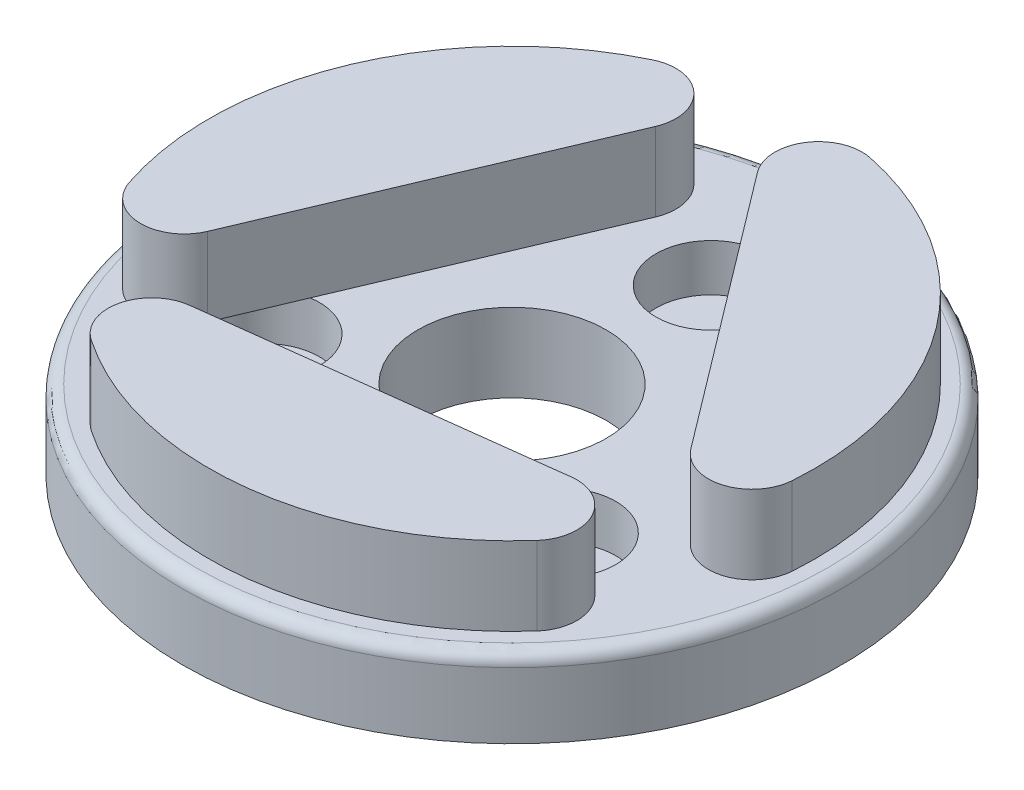
ISO-10303-21;
HEADER;
FILE_DESCRIPTION(('STEP AP214'),'2;1');
FILE_NAME('part.step','',(''),(''),'','','');
FILE_SCHEMA(('AUTOMOTIVE_DESIGN { 1 0 10303 214 1 1 1 1 }'));
ENDSEC;
DATA;
#1=APPLICATION_CONTEXT('core data for automotive mechanical design processes');
#2=APPLICATION_PROTOCOL_DEFINITION('international standard','automotive_design',2000,#1);
#3=PRODUCT_CONTEXT('',#1,'mechanical');
#4=PRODUCT('Part','Part','',(#3));
#5=PRODUCT_RELATED_PRODUCT_CATEGORY('part','',(#4));
#6=PRODUCT_DEFINITION_FORMATION('','',#4);
#7=PRODUCT_DEFINITION_CONTEXT('part definition',#1,'design');
#8=PRODUCT_DEFINITION('design','',#6,#7);
#9=PRODUCT_DEFINITION_SHAPE('','',#8);
#10=(LENGTH_UNIT() NAMED_UNIT(*) SI_UNIT(.MILLI.,.METRE.));
#11=(NAMED_UNIT(*) PLANE_ANGLE_UNIT() SI_UNIT($,.RADIAN.));
#12=(NAMED_UNIT(*) SI_UNIT($,.STERADIAN.) SOLID_ANGLE_UNIT());
#13=UNCERTAINTY_MEASURE_WITH_UNIT(LENGTH_MEASURE(1.E-05),#10,'distance_accuracy_value','');
#14=(GEOMETRIC_REPRESENTATION_CONTEXT(3) GLOBAL_UNCERTAINTY_ASSIGNED_CONTEXT((#13)) GLOBAL_UNIT_ASSIGNED_CONTEXT((#10,
#11,#12)) REPRESENTATION_CONTEXT('',''));
#15=CARTESIAN_POINT('',(0.,0.,0.));
#16=DIRECTION('',(0.,0.,1.));
#17=DIRECTION('',(1.,0.,0.));
#18=AXIS2_PLACEMENT_3D('',#15,#16,#17);
#19=CARTESIAN_POINT('',(0.,0.,0.));
#20=DIRECTION('',(0.,-1.,0.));
#21=DIRECTION('',(0.,0.,-1.));
#22=AXIS2_PLACEMENT_3D('',#19,#20,#21);
#23=CYLINDRICAL_SURFACE('',#22,5.99999999999999);
#24=CARTESIAN_POINT('',(0.,31.0875,0.));
#25=DIRECTION('',(0.,1.,0.));
#26=DIRECTION('',(0.,0.,1.));
#27=AXIS2_PLACEMENT_3D('',#24,#25,#26);
#28=CIRCLE('',#27,5.99999999999999);
#29=CARTESIAN_POINT('',(0.,31.0875,5.99999999999999));
#30=VERTEX_POINT('',#29);
#31=EDGE_CURVE('E425',#30,#30,#28,.T.);
#32=ORIENTED_EDGE('',*,*,#31,.F.);
#33=EDGE_LOOP('',(#32));
#34=FACE_BOUND('',#33,.T.);
#35=CARTESIAN_POINT('',(0.,36.0875,0.));
#36=DIRECTION('',(0.,-1.,0.));
#37=DIRECTION('',(0.,0.,-1.));
#38=AXIS2_PLACEMENT_3D('',#35,#36,#37);
#39=CIRCLE('',#38,5.99999999999999);
#40=CARTESIAN_POINT('',(0.,36.0875,-5.99999999999999));
#41=VERTEX_POINT('',#40);
#42=EDGE_CURVE('E301',#41,#41,#39,.T.);
#43=ORIENTED_EDGE('',*,*,#42,.F.);
#44=EDGE_LOOP('',(#43));
#45=FACE_BOUND('',#44,.T.);
#46=ADVANCED_FACE('F47',(#34,#45),#23,.F.);
#47=CARTESIAN_POINT('',(21.,36.0875,0.));
#48=DIRECTION('',(0.,1.,0.));
#49=DIRECTION('',(0.,0.,1.));
#50=AXIS2_PLACEMENT_3D('',#47,#48,#49);
#51=PLANE('',#50);
#52=CARTESIAN_POINT('',(-10.6521533525861,36.0875,5.12631170409008));
#53=DIRECTION('',(0.,1.,0.));
#54=DIRECTION('',(0.,0.,1.));
#55=AXIS2_PLACEMENT_3D('',#52,#53,#54);
#56=CIRCLE('',#55,3.5);
#57=CARTESIAN_POINT('',(-13.5963596262202,36.0875,7.018836319067));
#58=VERTEX_POINT('',#57);
#59=CARTESIAN_POINT('',(-11.1837255790534,36.0875,1.66691421781468));
#60=VERTEX_POINT('',#59);
#61=EDGE_CURVE('E440',#58,#60,#56,.T.);
#62=ORIENTED_EDGE('',*,*,#61,.F.);
#63=CARTESIAN_POINT('',(-15.6896930870227,36.0875,5.19439017263042));
#64=DIRECTION('',(0.,1.,0.));
#65=DIRECTION('',(0.,0.,-1.));
#66=AXIS2_PLACEMENT_3D('',#63,#64,#65);
#67=CIRCLE('',#66,2.77680548821167);
#68=CARTESIAN_POINT('',(-18.3257863357181,36.0875,6.06712214955396));
#69=VERTEX_POINT('',#68);
#70=EDGE_CURVE('E246',#69,#58,#67,.T.);
#71=ORIENTED_EDGE('',*,*,#70,.F.);
#72=CARTESIAN_POINT('',(0.,36.0875,0.));
#73=DIRECTION('',(0.,1.,0.));
#74=DIRECTION('',(0.,0.,-1.));
#75=AXIS2_PLACEMENT_3D('',#72,#73,#74);
#76=CIRCLE('',#75,19.304);
#77=CARTESIAN_POINT('',(-8.41678906424882,36.0875,-17.3724516936425));
#78=VERTEX_POINT('',#77);
#79=EDGE_CURVE('E263',#78,#69,#76,.T.);
#80=ORIENTED_EDGE('',*,*,#79,.F.);
#81=CARTESIAN_POINT('',(-7.20606661984736,36.0875,-14.8734919336653));
#82=DIRECTION('',(0.,1.,0.));
#83=DIRECTION('',(0.,0.,1.));
#84=AXIS2_PLACEMENT_3D('',#81,#82,#83);
#85=CIRCLE('',#84,2.77680548821167);
#86=CARTESIAN_POINT('',(-4.6484165193967,36.0875,-13.7922543635508));
#87=VERTEX_POINT('',#86);
#88=EDGE_CURVE('E281',#87,#78,#85,.T.);
#89=ORIENTED_EDGE('',*,*,#88,.F.);
#90=DIRECTION('',(0.389381818317748,0.,-0.921076435244961));
#91=VECTOR('',#90,1.);
#92=CARTESIAN_POINT('',(-13.132042986572,36.0875,6.27562774274498));
#93=LINE('',#92,#91);
#94=EDGE_CURVE('E276',#60,#87,#93,.T.);
#95=ORIENTED_EDGE('',*,*,#94,.F.);
#96=EDGE_LOOP('',(#62,#71,#80,#89,#95));
#97=FACE_BOUND('',#96,.T.);
#98=CARTESIAN_POINT('',(0.886560512833593,36.0875,-11.7881912603922));
#99=DIRECTION('',(0.,1.,0.));
#100=DIRECTION('',(0.,0.,1.));
#101=AXIS2_PLACEMENT_3D('',#98,#99,#100);
#102=CIRCLE('',#101,3.5);
#103=CARTESIAN_POINT('',(0.719689255793257,36.0875,-15.2842109948293));
#104=VERTEX_POINT('',#103);
#105=CARTESIAN_POINT('',(4.14827273096977,36.0875,-10.5188475693214));
#106=VERTEX_POINT('',#105);
#107=EDGE_CURVE('E443',#104,#106,#102,.T.);
#108=ORIENTED_EDGE('',*,*,#107,.F.);
#109=CARTESIAN_POINT('',(3.34637269684517,36.0875,-16.1848678772579));
#110=DIRECTION('',(0.,1.,0.));
#111=DIRECTION('',(0.,0.,-1.));
#112=AXIS2_PLACEMENT_3D('',#109,#110,#111);
#113=CIRCLE('',#112,2.77680548821167);
#114=CARTESIAN_POINT('',(3.90861125848208,36.0875,-18.9041575858346));
#115=VERTEX_POINT('',#114);
#116=EDGE_CURVE('E242',#115,#104,#113,.T.);
#117=ORIENTED_EDGE('',*,*,#116,.F.);
#118=CARTESIAN_POINT('',(0.,36.0875,0.));
#119=DIRECTION('',(0.,1.,0.));
#120=DIRECTION('',(0.,0.,-1.));
#121=AXIS2_PLACEMENT_3D('',#118,#119,#120);
#122=CIRCLE('',#121,19.304);
#123=CARTESIAN_POINT('',(19.2533790248368,36.0875,1.39707269888668));
#124=VERTEX_POINT('',#123);
#125=EDGE_CURVE('E229',#124,#115,#122,.T.);
#126=ORIENTED_EDGE('',*,*,#125,.F.);
#127=CARTESIAN_POINT('',(16.4838551674608,36.0875,1.19610921268178));
#128=DIRECTION('',(0.,1.,0.));
#129=DIRECTION('',(0.,0.,1.));
#130=AXIS2_PLACEMENT_3D('',#127,#128,#129);
#131=CIRCLE('',#130,2.77680548821167);
#132=CARTESIAN_POINT('',(14.2686509139901,36.0875,2.87048038860659));
#133=VERTEX_POINT('',#132);
#134=EDGE_CURVE('E232',#133,#124,#131,.T.);
#135=ORIENTED_EDGE('',*,*,#134,.F.);
#136=DIRECTION('',(0.602984682590475,0.,0.797752764057427));
#137=VECTOR('',#136,1.);
#138=CARTESIAN_POINT('',(1.13116844337448,36.0875,-14.5104967013331));
#139=LINE('',#138,#137);
#140=EDGE_CURVE('E237',#106,#133,#139,.T.);
#141=ORIENTED_EDGE('',*,*,#140,.F.);
#142=EDGE_LOOP('',(#108,#117,#126,#135,#141));
#143=FACE_BOUND('',#142,.T.);
#144=CARTESIAN_POINT('',(9.76559283975249,36.0875,6.66187955630218));
#145=DIRECTION('',(0.,1.,0.));
#146=DIRECTION('',(0.,0.,1.));
#147=AXIS2_PLACEMENT_3D('',#144,#145,#146);
#148=CIRCLE('',#147,3.5);
#149=CARTESIAN_POINT('',(12.876670370427,36.0875,8.26537467576231));
#150=VERTEX_POINT('',#149);
#151=CARTESIAN_POINT('',(7.03545284808356,36.0875,8.85193335150676));
#152=VERTEX_POINT('',#151);
#153=EDGE_CURVE('E174',#150,#152,#148,.T.);
#154=ORIENTED_EDGE('',*,*,#153,.F.);
#155=CARTESIAN_POINT('',(12.3433203901775,36.0875,10.9904777046275));
#156=DIRECTION('',(0.,1.,0.));
#157=DIRECTION('',(0.,0.,-1.));
#158=AXIS2_PLACEMENT_3D('',#155,#156,#157);
#159=CIRCLE('',#158,2.77680548821167);
#160=CARTESIAN_POINT('',(14.4171750772361,36.0875,12.8370354362806));
#161=VERTEX_POINT('',#160);
#162=EDGE_CURVE('E183',#161,#150,#159,.T.);
#163=ORIENTED_EDGE('',*,*,#162,.F.);
#164=CARTESIAN_POINT('',(0.,36.0875,0.));
#165=DIRECTION('',(0.,1.,0.));
#166=DIRECTION('',(0.,0.,-1.));
#167=AXIS2_PLACEMENT_3D('',#164,#165,#166);
#168=CIRCLE('',#167,19.304);
#169=CARTESIAN_POINT('',(-10.8365899605879,36.0875,15.9753789947558));
#170=VERTEX_POINT('',#169);
#171=EDGE_CURVE('E216',#170,#161,#168,.T.);
#172=ORIENTED_EDGE('',*,*,#171,.F.);
#173=CARTESIAN_POINT('',(-9.27778854761342,36.0875,13.6773827209836));
#174=DIRECTION('',(0.,1.,0.));
#175=DIRECTION('',(0.,0.,1.));
#176=AXIS2_PLACEMENT_3D('',#173,#174,#175);
#177=CIRCLE('',#176,2.77680548821167);
#178=CARTESIAN_POINT('',(-9.62023439459337,36.0875,10.9217739749442));
#179=VERTEX_POINT('',#178);
#180=EDGE_CURVE('E467',#179,#170,#177,.T.);
#181=ORIENTED_EDGE('',*,*,#180,.F.);
#182=DIRECTION('',(-0.992366500908222,0.,0.123323671187534));
#183=VECTOR('',#182,1.);
#184=CARTESIAN_POINT('',(12.0008745431976,36.0875,8.23486895858816));
#185=LINE('',#184,#183);
#186=EDGE_CURVE('E185',#152,#179,#185,.T.);
#187=ORIENTED_EDGE('',*,*,#186,.F.);
#188=EDGE_LOOP('',(#154,#163,#172,#181,#187));
#189=FACE_BOUND('',#188,.T.);
#190=CARTESIAN_POINT('',(0.,36.0875,0.));
#191=DIRECTION('',(0.,1.,0.));
#192=DIRECTION('',(0.,0.,1.));
#193=AXIS2_PLACEMENT_3D('',#190,#191,#192);
#194=CIRCLE('',#193,20.2);
#195=CARTESIAN_POINT('',(0.,36.0875,20.2));
#196=VERTEX_POINT('',#195);
#197=EDGE_CURVE('E11',#196,#196,#194,.T.);
#198=ORIENTED_EDGE('',*,*,#197,.T.);
#199=EDGE_LOOP('',(#198));
#200=FACE_BOUND('',#199,.T.);
#201=ORIENTED_EDGE('',*,*,#42,.T.);
#202=EDGE_LOOP('',(#201));
#203=FACE_BOUND('',#202,.T.);
#204=ADVANCED_FACE('F180',(#97,#143,#189,#200,#203),#51,.T.);
#205=CARTESIAN_POINT('',(0.,0.,0.));
#206=DIRECTION('',(0.,-1.,0.));
#207=DIRECTION('',(0.,0.,-1.));
#208=AXIS2_PLACEMENT_3D('',#205,#206,#207);
#209=CYLINDRICAL_SURFACE('',#208,21.);
#210=CARTESIAN_POINT('',(0.,31.0875,0.));
#211=DIRECTION('',(0.,1.,0.));
#212=DIRECTION('',(0.,0.,1.));
#213=AXIS2_PLACEMENT_3D('',#210,#211,#212);
#214=CIRCLE('',#213,21.);
#215=CARTESIAN_POINT('',(0.,31.0875,21.));
#216=VERTEX_POINT('',#215);
#217=EDGE_CURVE('E51',#216,#216,#214,.F.);
#218=ORIENTED_EDGE('',*,*,#217,.F.);
#219=EDGE_LOOP('',(#218));
#220=FACE_BOUND('',#219,.T.);
#221=CARTESIAN_POINT('',(0.,35.2875,0.));
#222=DIRECTION('',(0.,1.,0.));
#223=DIRECTION('',(0.,0.,1.));
#224=AXIS2_PLACEMENT_3D('',#221,#222,#223);
#225=CIRCLE('',#224,21.);
#226=CARTESIAN_POINT('',(0.,35.2875,21.));
#227=VERTEX_POINT('',#226);
#228=EDGE_CURVE('E57',#227,#227,#225,.F.);
#229=ORIENTED_EDGE('',*,*,#228,.T.);
#230=EDGE_LOOP('',(#229));
#231=FACE_BOUND('',#230,.T.);
#232=ADVANCED_FACE('F309',(#220,#231),#209,.T.);
#233=CARTESIAN_POINT('',(0.,35.2875,0.));
#234=DIRECTION('',(0.,1.,0.));
#235=DIRECTION('',(0.,0.,1.));
#236=AXIS2_PLACEMENT_3D('',#233,#234,#235);
#237=TOROIDAL_SURFACE('',#236,20.2,0.8);
#238=ORIENTED_EDGE('',*,*,#197,.F.);
#239=EDGE_LOOP('',(#238));
#240=FACE_BOUND('',#239,.T.);
#241=ORIENTED_EDGE('',*,*,#228,.F.);
#242=EDGE_LOOP('',(#241));
#243=FACE_BOUND('',#242,.T.);
#244=ADVANCED_FACE('F49',(#240,#243),#237,.T.);
#245=CARTESIAN_POINT('',(-15.6896930870227,41.0875,5.19439017263042));
#246=DIRECTION('',(0.,-1.,0.));
#247=DIRECTION('',(0.,0.,-1.));
#248=AXIS2_PLACEMENT_3D('',#245,#246,#247);
#249=CYLINDRICAL_SURFACE('',#248,2.77680548821167);
#250=ORIENTED_EDGE('',*,*,#70,.T.);
#251=CARTESIAN_POINT('',(-15.6896930870227,36.0875,5.19439017263042));
#252=DIRECTION('',(0.,1.,0.));
#253=DIRECTION('',(0.,0.,1.));
#254=AXIS2_PLACEMENT_3D('',#251,#252,#253);
#255=CIRCLE('',#254,2.77680548821167);
#256=CARTESIAN_POINT('',(-13.132042986572,36.0875,6.27562774274498));
#257=VERTEX_POINT('',#256);
#258=EDGE_CURVE('E450',#58,#257,#255,.T.);
#259=ORIENTED_EDGE('',*,*,#258,.T.);
#260=DIRECTION('',(0.,-1.,0.));
#261=VECTOR('',#260,1.);
#262=CARTESIAN_POINT('',(-13.132042986572,41.0875,6.27562774274498));
#263=LINE('',#262,#261);
#264=CARTESIAN_POINT('',(-13.132042986572,41.0875,6.27562774274498));
#265=VERTEX_POINT('',#264);
#266=EDGE_CURVE('E297',#265,#257,#263,.T.);
#267=ORIENTED_EDGE('',*,*,#266,.F.);
#268=CARTESIAN_POINT('',(-15.6896930870227,41.0875,5.19439017263042));
#269=DIRECTION('',(0.,1.,0.));
#270=DIRECTION('',(0.,0.,-1.));
#271=AXIS2_PLACEMENT_3D('',#268,#269,#270);
#272=CIRCLE('',#271,2.77680548821167);
#273=CARTESIAN_POINT('',(-18.3257863357181,41.0875,6.06712214955396));
#274=VERTEX_POINT('',#273);
#275=EDGE_CURVE('E258',#274,#265,#272,.T.);
#276=ORIENTED_EDGE('',*,*,#275,.F.);
#277=DIRECTION('',(0.,-1.,0.));
#278=VECTOR('',#277,1.);
#279=CARTESIAN_POINT('',(-18.3257863357181,41.0875,6.06712214955396));
#280=LINE('',#279,#278);
#281=EDGE_CURVE('E272',#274,#69,#280,.T.);
#282=ORIENTED_EDGE('',*,*,#281,.T.);
#283=EDGE_LOOP('',(#250,#259,#267,#276,#282));
#284=FACE_BOUND('',#283,.T.);
#285=ADVANCED_FACE('F312',(#284),#249,.T.);
#286=CARTESIAN_POINT('',(-13.132042986572,41.0875,6.27562774274498));
#287=DIRECTION('',(-0.921076435244961,0.,-0.389381818317748));
#288=DIRECTION('',(-0.389381818317748,0.,0.921076435244961));
#289=AXIS2_PLACEMENT_3D('',#286,#287,#288);
#290=PLANE('',#289);
#291=EDGE_CURVE('E277',#257,#60,#93,.T.);
#292=ORIENTED_EDGE('',*,*,#291,.T.);
#293=ORIENTED_EDGE('',*,*,#94,.T.);
#294=DIRECTION('',(0.,-1.,0.));
#295=VECTOR('',#294,1.);
#296=CARTESIAN_POINT('',(-4.6484165193967,41.0875,-13.7922543635508));
#297=LINE('',#296,#295);
#298=CARTESIAN_POINT('',(-4.6484165193967,41.0875,-13.7922543635508));
#299=VERTEX_POINT('',#298);
#300=EDGE_CURVE('E293',#299,#87,#297,.T.);
#301=ORIENTED_EDGE('',*,*,#300,.F.);
#302=DIRECTION('',(0.389381818317748,0.,-0.921076435244961));
#303=VECTOR('',#302,1.);
#304=CARTESIAN_POINT('',(-13.132042986572,41.0875,6.27562774274498));
#305=LINE('',#304,#303);
#306=EDGE_CURVE('E262',#265,#299,#305,.T.);
#307=ORIENTED_EDGE('',*,*,#306,.F.);
#308=ORIENTED_EDGE('',*,*,#266,.T.);
#309=EDGE_LOOP('',(#292,#293,#301,#307,#308));
#310=FACE_BOUND('',#309,.T.);
#311=ADVANCED_FACE('F318',(#310),#290,.F.);
#312=CARTESIAN_POINT('',(-7.20606661984736,41.0875,-14.8734919336653));
#313=DIRECTION('',(0.,-1.,0.));
#314=DIRECTION('',(0.,0.,-1.));
#315=AXIS2_PLACEMENT_3D('',#312,#313,#314);
#316=CYLINDRICAL_SURFACE('',#315,2.77680548821167);
#317=ORIENTED_EDGE('',*,*,#88,.T.);
#318=DIRECTION('',(0.,-1.,0.));
#319=VECTOR('',#318,1.);
#320=CARTESIAN_POINT('',(-8.41678906424884,41.0875,-17.3724516936425));
#321=LINE('',#320,#319);
#322=CARTESIAN_POINT('',(-8.41678906424884,41.0875,-17.3724516936425));
#323=VERTEX_POINT('',#322);
#324=EDGE_CURVE('E290',#323,#78,#321,.T.);
#325=ORIENTED_EDGE('',*,*,#324,.F.);
#326=CARTESIAN_POINT('',(-7.20606661984736,41.0875,-14.8734919336653));
#327=DIRECTION('',(0.,1.,0.));
#328=DIRECTION('',(0.,0.,1.));
#329=AXIS2_PLACEMENT_3D('',#326,#327,#328);
#330=CIRCLE('',#329,2.77680548821167);
#331=EDGE_CURVE('E266',#299,#323,#330,.T.);
#332=ORIENTED_EDGE('',*,*,#331,.F.);
#333=ORIENTED_EDGE('',*,*,#300,.T.);
#334=EDGE_LOOP('',(#317,#325,#332,#333));
#335=FACE_BOUND('',#334,.T.);
#336=ADVANCED_FACE('F338',(#335),#316,.T.);
#337=CARTESIAN_POINT('',(0.,41.0875,0.));
#338=DIRECTION('',(0.,-1.,0.));
#339=DIRECTION('',(0.,0.,-1.));
#340=AXIS2_PLACEMENT_3D('',#337,#338,#339);
#341=CYLINDRICAL_SURFACE('',#340,19.304);
#342=ORIENTED_EDGE('',*,*,#79,.T.);
#343=ORIENTED_EDGE('',*,*,#281,.F.);
#344=CARTESIAN_POINT('',(0.,41.0875,0.));
#345=DIRECTION('',(0.,1.,0.));
#346=DIRECTION('',(0.,0.,-1.));
#347=AXIS2_PLACEMENT_3D('',#344,#345,#346);
#348=CIRCLE('',#347,19.304);
#349=EDGE_CURVE('E269',#323,#274,#348,.T.);
#350=ORIENTED_EDGE('',*,*,#349,.F.);
#351=ORIENTED_EDGE('',*,*,#324,.T.);
#352=EDGE_LOOP('',(#342,#343,#350,#351));
#353=FACE_BOUND('',#352,.T.);
#354=ADVANCED_FACE('F341',(#353),#341,.T.);
#355=CARTESIAN_POINT('',(-15.6896930870227,41.0875,5.19439017263042));
#356=DIRECTION('',(0.,-1.,0.));
#357=DIRECTION('',(0.,0.,-1.));
#358=AXIS2_PLACEMENT_3D('',#355,#356,#357);
#359=PLANE('',#358);
#360=ORIENTED_EDGE('',*,*,#275,.T.);
#361=ORIENTED_EDGE('',*,*,#306,.T.);
#362=ORIENTED_EDGE('',*,*,#331,.T.);
#363=ORIENTED_EDGE('',*,*,#349,.T.);
#364=EDGE_LOOP('',(#360,#361,#362,#363));
#365=FACE_BOUND('',#364,.T.);
#366=ADVANCED_FACE('F345',(#365),#359,.F.);
#367=CARTESIAN_POINT('',(3.34637269684517,41.0875,-16.1848678772579));
#368=DIRECTION('',(0.,-1.,0.));
#369=DIRECTION('',(0.,0.,-1.));
#370=AXIS2_PLACEMENT_3D('',#367,#368,#369);
#371=CYLINDRICAL_SURFACE('',#370,2.77680548821167);
#372=ORIENTED_EDGE('',*,*,#116,.T.);
#373=CARTESIAN_POINT('',(3.34637269684517,36.0875,-16.1848678772579));
#374=DIRECTION('',(0.,1.,0.));
#375=DIRECTION('',(0.,0.,1.));
#376=AXIS2_PLACEMENT_3D('',#373,#374,#375);
#377=CIRCLE('',#376,2.77680548821167);
#378=CARTESIAN_POINT('',(1.13116844337448,36.0875,-14.5104967013331));
#379=VERTEX_POINT('',#378);
#380=EDGE_CURVE('E168',#104,#379,#377,.T.);
#381=ORIENTED_EDGE('',*,*,#380,.T.);
#382=DIRECTION('',(0.,-1.,0.));
#383=VECTOR('',#382,1.);
#384=CARTESIAN_POINT('',(1.13116844337448,41.0875,-14.5104967013331));
#385=LINE('',#384,#383);
#386=CARTESIAN_POINT('',(1.13116844337448,41.0875,-14.5104967013331));
#387=VERTEX_POINT('',#386);
#388=EDGE_CURVE('E194',#387,#379,#385,.T.);
#389=ORIENTED_EDGE('',*,*,#388,.F.);
#390=CARTESIAN_POINT('',(3.34637269684517,41.0875,-16.1848678772579));
#391=DIRECTION('',(0.,1.,0.));
#392=DIRECTION('',(0.,0.,-1.));
#393=AXIS2_PLACEMENT_3D('',#390,#391,#392);
#394=CIRCLE('',#393,2.77680548821167);
#395=CARTESIAN_POINT('',(3.90861125848208,41.0875,-18.9041575858346));
#396=VERTEX_POINT('',#395);
#397=EDGE_CURVE('E233',#396,#387,#394,.T.);
#398=ORIENTED_EDGE('',*,*,#397,.F.);
#399=DIRECTION('',(0.,-1.,0.));
#400=VECTOR('',#399,1.);
#401=CARTESIAN_POINT('',(3.90861125848208,41.0875,-18.9041575858346));
#402=LINE('',#401,#400);
#403=EDGE_CURVE('E224',#396,#115,#402,.T.);
#404=ORIENTED_EDGE('',*,*,#403,.T.);
#405=EDGE_LOOP('',(#372,#381,#389,#398,#404));
#406=FACE_BOUND('',#405,.T.);
#407=ADVANCED_FACE('F349',(#406),#371,.T.);
#408=CARTESIAN_POINT('',(1.13116844337448,41.0875,-14.5104967013331));
#409=DIRECTION('',(0.797752764057427,0.,-0.602984682590475));
#410=DIRECTION('',(-0.602984682590475,0.,-0.797752764057427));
#411=AXIS2_PLACEMENT_3D('',#408,#409,#410);
#412=PLANE('',#411);
#413=EDGE_CURVE('E238',#379,#106,#139,.T.);
#414=ORIENTED_EDGE('',*,*,#413,.T.);
#415=ORIENTED_EDGE('',*,*,#140,.T.);
#416=DIRECTION('',(0.,-1.,0.));
#417=VECTOR('',#416,1.);
#418=CARTESIAN_POINT('',(14.2686509139901,41.0875,2.87048038860659));
#419=LINE('',#418,#417);
#420=CARTESIAN_POINT('',(14.2686509139901,41.0875,2.87048038860659));
#421=VERTEX_POINT('',#420);
#422=EDGE_CURVE('E199',#421,#133,#419,.T.);
#423=ORIENTED_EDGE('',*,*,#422,.F.);
#424=DIRECTION('',(0.602984682590475,0.,0.797752764057427));
#425=VECTOR('',#424,1.);
#426=CARTESIAN_POINT('',(1.13116844337448,41.0875,-14.5104967013331));
#427=LINE('',#426,#425);
#428=EDGE_CURVE('E252',#387,#421,#427,.T.);
#429=ORIENTED_EDGE('',*,*,#428,.F.);
#430=ORIENTED_EDGE('',*,*,#388,.T.);
#431=EDGE_LOOP('',(#414,#415,#423,#429,#430));
#432=FACE_BOUND('',#431,.T.);
#433=ADVANCED_FACE('F362',(#432),#412,.F.);
#434=CARTESIAN_POINT('',(16.4838551674608,41.0875,1.19610921268178));
#435=DIRECTION('',(0.,-1.,0.));
#436=DIRECTION('',(0.,0.,-1.));
#437=AXIS2_PLACEMENT_3D('',#434,#435,#436);
#438=CYLINDRICAL_SURFACE('',#437,2.77680548821167);
#439=ORIENTED_EDGE('',*,*,#134,.T.);
#440=DIRECTION('',(0.,-1.,0.));
#441=VECTOR('',#440,1.);
#442=CARTESIAN_POINT('',(19.2533790248368,41.0875,1.39707269888668));
#443=LINE('',#442,#441);
#444=CARTESIAN_POINT('',(19.2533790248368,41.0875,1.39707269888668));
#445=VERTEX_POINT('',#444);
#446=EDGE_CURVE('E221',#445,#124,#443,.T.);
#447=ORIENTED_EDGE('',*,*,#446,.F.);
#448=CARTESIAN_POINT('',(16.4838551674608,41.0875,1.19610921268178));
#449=DIRECTION('',(0.,1.,0.));
#450=DIRECTION('',(0.,0.,1.));
#451=AXIS2_PLACEMENT_3D('',#448,#449,#450);
#452=CIRCLE('',#451,2.77680548821167);
#453=EDGE_CURVE('E249',#421,#445,#452,.T.);
#454=ORIENTED_EDGE('',*,*,#453,.F.);
#455=ORIENTED_EDGE('',*,*,#422,.T.);
#456=EDGE_LOOP('',(#439,#447,#454,#455));
#457=FACE_BOUND('',#456,.T.);
#458=ADVANCED_FACE('F358',(#457),#438,.T.);
#459=CARTESIAN_POINT('',(0.,41.0875,0.));
#460=DIRECTION('',(0.,-1.,0.));
#461=DIRECTION('',(0.,0.,-1.));
#462=AXIS2_PLACEMENT_3D('',#459,#460,#461);
#463=CYLINDRICAL_SURFACE('',#462,19.304);
#464=ORIENTED_EDGE('',*,*,#125,.T.);
#465=ORIENTED_EDGE('',*,*,#403,.F.);
#466=CARTESIAN_POINT('',(0.,41.0875,0.));
#467=DIRECTION('',(0.,1.,0.));
#468=DIRECTION('',(0.,0.,-1.));
#469=AXIS2_PLACEMENT_3D('',#466,#467,#468);
#470=CIRCLE('',#469,19.304);
#471=EDGE_CURVE('E228',#445,#396,#470,.T.);
#472=ORIENTED_EDGE('',*,*,#471,.F.);
#473=ORIENTED_EDGE('',*,*,#446,.T.);
#474=EDGE_LOOP('',(#464,#465,#472,#473));
#475=FACE_BOUND('',#474,.T.);
#476=ADVANCED_FACE('F354',(#475),#463,.T.);
#477=CARTESIAN_POINT('',(3.34637269684517,41.0875,-16.1848678772579));
#478=DIRECTION('',(0.,-1.,0.));
#479=DIRECTION('',(0.,0.,-1.));
#480=AXIS2_PLACEMENT_3D('',#477,#478,#479);
#481=PLANE('',#480);
#482=ORIENTED_EDGE('',*,*,#397,.T.);
#483=ORIENTED_EDGE('',*,*,#428,.T.);
#484=ORIENTED_EDGE('',*,*,#453,.T.);
#485=ORIENTED_EDGE('',*,*,#471,.T.);
#486=EDGE_LOOP('',(#482,#483,#484,#485));
#487=FACE_BOUND('',#486,.T.);
#488=ADVANCED_FACE('F351',(#487),#481,.F.);
#489=CARTESIAN_POINT('',(12.3433203901775,41.0875,10.9904777046275));
#490=DIRECTION('',(0.,-1.,0.));
#491=DIRECTION('',(0.,0.,-1.));
#492=AXIS2_PLACEMENT_3D('',#489,#490,#491);
#493=CYLINDRICAL_SURFACE('',#492,2.77680548821167);
#494=ORIENTED_EDGE('',*,*,#162,.T.);
#495=CARTESIAN_POINT('',(12.3433203901775,36.0875,10.9904777046275));
#496=DIRECTION('',(0.,1.,0.));
#497=DIRECTION('',(0.,0.,1.));
#498=AXIS2_PLACEMENT_3D('',#495,#496,#497);
#499=CIRCLE('',#498,2.77680548821167);
#500=CARTESIAN_POINT('',(12.0008745431976,36.0875,8.23486895858816));
#501=VERTEX_POINT('',#500);
#502=EDGE_CURVE('E156',#150,#501,#499,.T.);
#503=ORIENTED_EDGE('',*,*,#502,.T.);
#504=DIRECTION('',(0.,-1.,0.));
#505=VECTOR('',#504,1.);
#506=CARTESIAN_POINT('',(12.0008745431976,41.0875,8.23486895858816));
#507=LINE('',#506,#505);
#508=CARTESIAN_POINT('',(12.0008745431976,41.0875,8.23486895858816));
#509=VERTEX_POINT('',#508);
#510=EDGE_CURVE('E454',#509,#501,#507,.T.);
#511=ORIENTED_EDGE('',*,*,#510,.F.);
#512=CARTESIAN_POINT('',(12.3433203901775,41.0875,10.9904777046275));
#513=DIRECTION('',(0.,1.,0.));
#514=DIRECTION('',(0.,0.,-1.));
#515=AXIS2_PLACEMENT_3D('',#512,#513,#514);
#516=CIRCLE('',#515,2.77680548821167);
#517=CARTESIAN_POINT('',(14.4171750772361,41.0875,12.8370354362806));
#518=VERTEX_POINT('',#517);
#519=EDGE_CURVE('E213',#518,#509,#516,.T.);
#520=ORIENTED_EDGE('',*,*,#519,.F.);
#521=DIRECTION('',(0.,-1.,0.));
#522=VECTOR('',#521,1.);
#523=CARTESIAN_POINT('',(14.4171750772361,41.0875,12.8370354362806));
#524=LINE('',#523,#522);
#525=EDGE_CURVE('E192',#518,#161,#524,.T.);
#526=ORIENTED_EDGE('',*,*,#525,.T.);
#527=EDGE_LOOP('',(#494,#503,#511,#520,#526));
#528=FACE_BOUND('',#527,.T.);
#529=ADVANCED_FACE('F189',(#528),#493,.T.);
#530=CARTESIAN_POINT('',(12.0008745431976,41.0875,8.23486895858816));
#531=DIRECTION('',(0.123323671187534,0.,0.992366500908222));
#532=DIRECTION('',(0.992366500908222,0.,-0.123323671187534));
#533=AXIS2_PLACEMENT_3D('',#530,#531,#532);
#534=PLANE('',#533);
#535=EDGE_CURVE('E162',#501,#152,#185,.T.);
#536=ORIENTED_EDGE('',*,*,#535,.T.);
#537=ORIENTED_EDGE('',*,*,#186,.T.);
#538=DIRECTION('',(0.,-1.,0.));
#539=VECTOR('',#538,1.);
#540=CARTESIAN_POINT('',(-9.62023439459337,41.0875,10.9217739749442));
#541=LINE('',#540,#539);
#542=CARTESIAN_POINT('',(-9.62023439459337,41.0875,10.9217739749442));
#543=VERTEX_POINT('',#542);
#544=EDGE_CURVE('E457',#543,#179,#541,.T.);
#545=ORIENTED_EDGE('',*,*,#544,.F.);
#546=DIRECTION('',(-0.992366500908222,0.,0.123323671187534));
#547=VECTOR('',#546,1.);
#548=CARTESIAN_POINT('',(12.0008745431976,41.0875,8.23486895858816));
#549=LINE('',#548,#547);
#550=EDGE_CURVE('E210',#509,#543,#549,.T.);
#551=ORIENTED_EDGE('',*,*,#550,.F.);
#552=ORIENTED_EDGE('',*,*,#510,.T.);
#553=EDGE_LOOP('',(#536,#537,#545,#551,#552));
#554=FACE_BOUND('',#553,.T.);
#555=ADVANCED_FACE('F381',(#554),#534,.F.);
#556=CARTESIAN_POINT('',(-9.27778854761342,41.0875,13.6773827209836));
#557=DIRECTION('',(0.,-1.,0.));
#558=DIRECTION('',(0.,0.,-1.));
#559=AXIS2_PLACEMENT_3D('',#556,#557,#558);
#560=CYLINDRICAL_SURFACE('',#559,2.77680548821167);
#561=ORIENTED_EDGE('',*,*,#180,.T.);
#562=DIRECTION('',(0.,-1.,0.));
#563=VECTOR('',#562,1.);
#564=CARTESIAN_POINT('',(-10.8365899605879,41.0875,15.9753789947558));
#565=LINE('',#564,#563);
#566=CARTESIAN_POINT('',(-10.8365899605879,41.0875,15.9753789947558));
#567=VERTEX_POINT('',#566);
#568=EDGE_CURVE('E461',#567,#170,#565,.T.);
#569=ORIENTED_EDGE('',*,*,#568,.F.);
#570=CARTESIAN_POINT('',(-9.27778854761342,41.0875,13.6773827209836));
#571=DIRECTION('',(0.,1.,0.));
#572=DIRECTION('',(0.,0.,1.));
#573=AXIS2_PLACEMENT_3D('',#570,#571,#572);
#574=CIRCLE('',#573,2.77680548821167);
#575=EDGE_CURVE('E207',#543,#567,#574,.T.);
#576=ORIENTED_EDGE('',*,*,#575,.F.);
#577=ORIENTED_EDGE('',*,*,#544,.T.);
#578=EDGE_LOOP('',(#561,#569,#576,#577));
#579=FACE_BOUND('',#578,.T.);
#580=ADVANCED_FACE('F377',(#579),#560,.T.);
#581=CARTESIAN_POINT('',(0.,41.0875,0.));
#582=DIRECTION('',(0.,-1.,0.));
#583=DIRECTION('',(0.,0.,-1.));
#584=AXIS2_PLACEMENT_3D('',#581,#582,#583);
#585=CYLINDRICAL_SURFACE('',#584,19.304);
#586=ORIENTED_EDGE('',*,*,#171,.T.);
#587=ORIENTED_EDGE('',*,*,#525,.F.);
#588=CARTESIAN_POINT('',(0.,41.0875,0.));
#589=DIRECTION('',(0.,1.,0.));
#590=DIRECTION('',(0.,0.,-1.));
#591=AXIS2_PLACEMENT_3D('',#588,#589,#590);
#592=CIRCLE('',#591,19.304);
#593=EDGE_CURVE('E204',#567,#518,#592,.T.);
#594=ORIENTED_EDGE('',*,*,#593,.F.);
#595=ORIENTED_EDGE('',*,*,#568,.T.);
#596=EDGE_LOOP('',(#586,#587,#594,#595));
#597=FACE_BOUND('',#596,.T.);
#598=ADVANCED_FACE('F373',(#597),#585,.T.);
#599=CARTESIAN_POINT('',(12.3433203901775,41.0875,10.9904777046275));
#600=DIRECTION('',(0.,-1.,0.));
#601=DIRECTION('',(0.,0.,-1.));
#602=AXIS2_PLACEMENT_3D('',#599,#600,#601);
#603=PLANE('',#602);
#604=ORIENTED_EDGE('',*,*,#519,.T.);
#605=ORIENTED_EDGE('',*,*,#550,.T.);
#606=ORIENTED_EDGE('',*,*,#575,.T.);
#607=ORIENTED_EDGE('',*,*,#593,.T.);
#608=EDGE_LOOP('',(#604,#605,#606,#607));
#609=FACE_BOUND('',#608,.T.);
#610=ADVANCED_FACE('F370',(#609),#603,.F.);
#611=CARTESIAN_POINT('',(9.76559283975249,36.0875,6.66187955630218));
#612=DIRECTION('',(0.,1.,0.));
#613=DIRECTION('',(0.,0.,1.));
#614=AXIS2_PLACEMENT_3D('',#611,#612,#613);
#615=PLANE('',#614);
#616=EDGE_CURVE('E159',#152,#150,#148,.T.);
#617=ORIENTED_EDGE('',*,*,#616,.F.);
#618=ORIENTED_EDGE('',*,*,#535,.F.);
#619=ORIENTED_EDGE('',*,*,#502,.F.);
#620=EDGE_LOOP('',(#617,#618,#619));
#621=FACE_BOUND('',#620,.T.);
#622=ADVANCED_FACE('F158',(#621),#615,.F.);
#623=CARTESIAN_POINT('',(9.76559283975249,33.0875,6.66187955630218));
#624=DIRECTION('',(0.,1.,0.));
#625=DIRECTION('',(0.,0.,1.));
#626=AXIS2_PLACEMENT_3D('',#623,#624,#625);
#627=CYLINDRICAL_SURFACE('',#626,3.5);
#628=CARTESIAN_POINT('',(9.76559283975249,33.0875,6.66187955630218));
#629=DIRECTION('',(0.,1.,0.));
#630=DIRECTION('',(0.,0.,1.));
#631=AXIS2_PLACEMENT_3D('',#628,#629,#630);
#632=CIRCLE('',#631,3.5);
#633=CARTESIAN_POINT('',(9.76559283975249,33.0875,10.1618795563022));
#634=VERTEX_POINT('',#633);
#635=EDGE_CURVE('E176',#634,#634,#632,.T.);
#636=ORIENTED_EDGE('',*,*,#635,.F.);
#637=EDGE_LOOP('',(#636));
#638=FACE_BOUND('',#637,.T.);
#639=ORIENTED_EDGE('',*,*,#153,.T.);
#640=ORIENTED_EDGE('',*,*,#616,.T.);
#641=EDGE_LOOP('',(#639,#640));
#642=FACE_BOUND('',#641,.T.);
#643=ADVANCED_FACE('F173',(#638,#642),#627,.F.);
#644=CARTESIAN_POINT('',(9.76559283975249,33.0875,6.66187955630218));
#645=DIRECTION('',(0.,1.,0.));
#646=DIRECTION('',(0.,0.,1.));
#647=AXIS2_PLACEMENT_3D('',#644,#645,#646);
#648=PLANE('',#647);
#649=ORIENTED_EDGE('',*,*,#635,.T.);
#650=EDGE_LOOP('',(#649));
#651=FACE_BOUND('',#650,.T.);
#652=ADVANCED_FACE('F388',(#651),#648,.T.);
#653=CARTESIAN_POINT('',(0.886560512833593,36.0875,-11.7881912603922));
#654=DIRECTION('',(0.,1.,0.));
#655=DIRECTION('',(0.,0.,1.));
#656=AXIS2_PLACEMENT_3D('',#653,#654,#655);
#657=PLANE('',#656);
#658=EDGE_CURVE('E72',#106,#104,#102,.T.);
#659=ORIENTED_EDGE('',*,*,#658,.F.);
#660=ORIENTED_EDGE('',*,*,#413,.F.);
#661=ORIENTED_EDGE('',*,*,#380,.F.);
#662=EDGE_LOOP('',(#659,#660,#661));
#663=FACE_BOUND('',#662,.T.);
#664=ADVANCED_FACE('F391',(#663),#657,.F.);
#665=CARTESIAN_POINT('',(0.886560512833593,33.0875,-11.7881912603922));
#666=DIRECTION('',(0.,1.,0.));
#667=DIRECTION('',(0.,0.,1.));
#668=AXIS2_PLACEMENT_3D('',#665,#666,#667);
#669=CYLINDRICAL_SURFACE('',#668,3.5);
#670=CARTESIAN_POINT('',(0.886560512833593,33.0875,-11.7881912603922));
#671=DIRECTION('',(0.,1.,0.));
#672=DIRECTION('',(0.,0.,1.));
#673=AXIS2_PLACEMENT_3D('',#670,#671,#672);
#674=CIRCLE('',#673,3.5);
#675=CARTESIAN_POINT('',(0.886560512833593,33.0875,-8.28819126039217));
#676=VERTEX_POINT('',#675);
#677=EDGE_CURVE('E187',#676,#676,#674,.T.);
#678=ORIENTED_EDGE('',*,*,#677,.F.);
#679=EDGE_LOOP('',(#678));
#680=FACE_BOUND('',#679,.T.);
#681=ORIENTED_EDGE('',*,*,#658,.T.);
#682=ORIENTED_EDGE('',*,*,#107,.T.);
#683=EDGE_LOOP('',(#681,#682));
#684=FACE_BOUND('',#683,.T.);
#685=ADVANCED_FACE('F402',(#680,#684),#669,.F.);
#686=CARTESIAN_POINT('',(0.886560512833593,33.0875,-11.7881912603922));
#687=DIRECTION('',(0.,1.,0.));
#688=DIRECTION('',(0.,0.,1.));
#689=AXIS2_PLACEMENT_3D('',#686,#687,#688);
#690=PLANE('',#689);
#691=ORIENTED_EDGE('',*,*,#677,.T.);
#692=EDGE_LOOP('',(#691));
#693=FACE_BOUND('',#692,.T.);
#694=ADVANCED_FACE('F398',(#693),#690,.T.);
#695=CARTESIAN_POINT('',(-10.6521533525861,36.0875,5.12631170409008));
#696=DIRECTION('',(0.,1.,0.));
#697=DIRECTION('',(0.,0.,1.));
#698=AXIS2_PLACEMENT_3D('',#695,#696,#697);
#699=PLANE('',#698);
#700=EDGE_CURVE('E64',#60,#58,#56,.T.);
#701=ORIENTED_EDGE('',*,*,#700,.F.);
#702=ORIENTED_EDGE('',*,*,#291,.F.);
#703=ORIENTED_EDGE('',*,*,#258,.F.);
#704=EDGE_LOOP('',(#701,#702,#703));
#705=FACE_BOUND('',#704,.T.);
#706=ADVANCED_FACE('F401',(#705),#699,.F.);
#707=CARTESIAN_POINT('',(-10.6521533525861,33.0875,5.12631170409008));
#708=DIRECTION('',(0.,1.,0.));
#709=DIRECTION('',(0.,0.,1.));
#710=AXIS2_PLACEMENT_3D('',#707,#708,#709);
#711=CYLINDRICAL_SURFACE('',#710,3.5);
#712=CARTESIAN_POINT('',(-10.6521533525861,33.0875,5.12631170409008));
#713=DIRECTION('',(0.,1.,0.));
#714=DIRECTION('',(0.,0.,1.));
#715=AXIS2_PLACEMENT_3D('',#712,#713,#714);
#716=CIRCLE('',#715,3.5);
#717=CARTESIAN_POINT('',(-10.6521533525861,33.0875,8.62631170409008));
#718=VERTEX_POINT('',#717);
#719=EDGE_CURVE('E169',#718,#718,#716,.T.);
#720=ORIENTED_EDGE('',*,*,#719,.F.);
#721=EDGE_LOOP('',(#720));
#722=FACE_BOUND('',#721,.T.);
#723=ORIENTED_EDGE('',*,*,#700,.T.);
#724=ORIENTED_EDGE('',*,*,#61,.T.);
#725=EDGE_LOOP('',(#723,#724));
#726=FACE_BOUND('',#725,.T.);
#727=ADVANCED_FACE('F409',(#722,#726),#711,.F.);
#728=CARTESIAN_POINT('',(-10.6521533525861,33.0875,5.12631170409008));
#729=DIRECTION('',(0.,1.,0.));
#730=DIRECTION('',(0.,0.,1.));
#731=AXIS2_PLACEMENT_3D('',#728,#729,#730);
#732=PLANE('',#731);
#733=ORIENTED_EDGE('',*,*,#719,.T.);
#734=EDGE_LOOP('',(#733));
#735=FACE_BOUND('',#734,.T.);
#736=ADVANCED_FACE('F412',(#735),#732,.T.);
#737=CARTESIAN_POINT('',(0.,31.0875,0.));
#738=DIRECTION('',(0.,1.,0.));
#739=DIRECTION('',(0.,0.,1.));
#740=AXIS2_PLACEMENT_3D('',#737,#738,#739);
#741=PLANE('',#740);
#742=ORIENTED_EDGE('',*,*,#31,.T.);
#743=EDGE_LOOP('',(#742));
#744=FACE_BOUND('',#743,.T.);
#745=ORIENTED_EDGE('',*,*,#217,.T.);
#746=EDGE_LOOP('',(#745));
#747=FACE_BOUND('',#746,.T.);
#748=ADVANCED_FACE('F417',(#744,#747),#741,.F.);
#749=CLOSED_SHELL('',(#46,#204,#232,#244,#285,#311,#336,#354,#366,#407,#433,#458,#476,#488,#529,
#555,#580,#598,#610,#622,#643,#652,#664,#685,#694,#706,#727,#736,#748));
#750=MANIFOLD_SOLID_BREP('B2',#749);
#751=ADVANCED_BREP_SHAPE_REPRESENTATION('',(#18,#750),#14);
#752=SHAPE_DEFINITION_REPRESENTATION(#9,#751);
ENDSEC;
END-ISO-10303-21;
